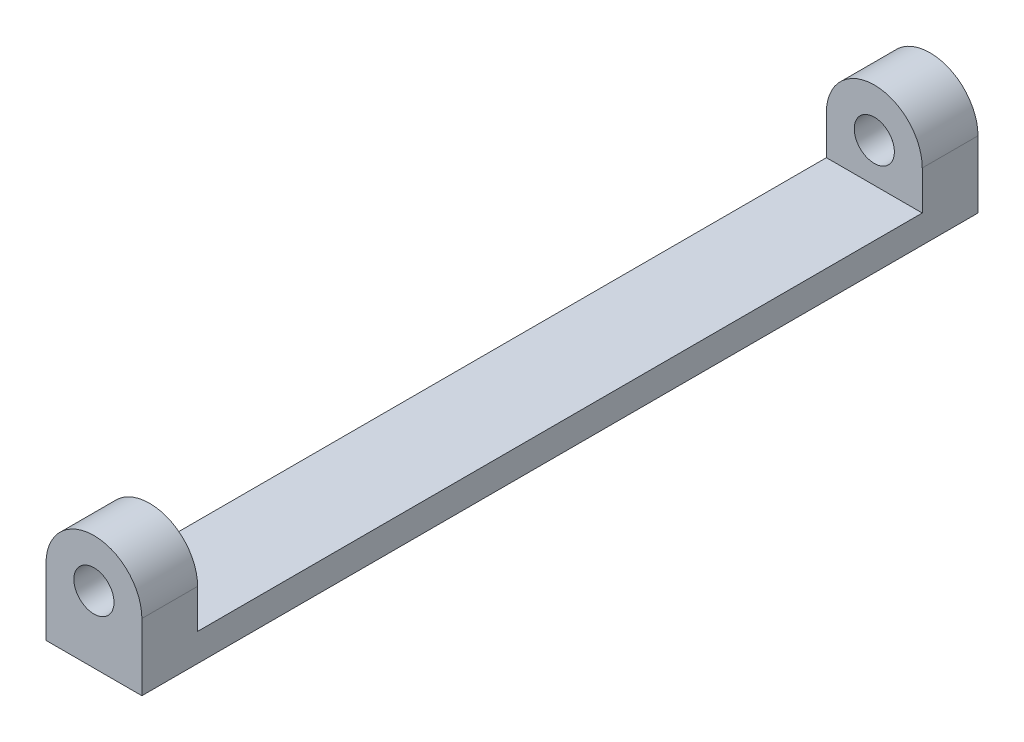
ISO-10303-21;
HEADER;
FILE_DESCRIPTION(('STEP AP214'),'2;1');
FILE_NAME('part.step','',(''),(''),'','','');
FILE_SCHEMA(('AUTOMOTIVE_DESIGN { 1 0 10303 214 1 1 1 1 }'));
ENDSEC;
DATA;
#1=APPLICATION_CONTEXT('core data for automotive mechanical design processes');
#2=APPLICATION_PROTOCOL_DEFINITION('international standard','automotive_design',2000,#1);
#3=PRODUCT_CONTEXT('',#1,'mechanical');
#4=PRODUCT('Part','Part','',(#3));
#5=PRODUCT_RELATED_PRODUCT_CATEGORY('part','',(#4));
#6=PRODUCT_DEFINITION_FORMATION('','',#4);
#7=PRODUCT_DEFINITION_CONTEXT('part definition',#1,'design');
#8=PRODUCT_DEFINITION('design','',#6,#7);
#9=PRODUCT_DEFINITION_SHAPE('','',#8);
#10=(LENGTH_UNIT() NAMED_UNIT(*) SI_UNIT(.MILLI.,.METRE.));
#11=(NAMED_UNIT(*) PLANE_ANGLE_UNIT() SI_UNIT($,.RADIAN.));
#12=(NAMED_UNIT(*) SI_UNIT($,.STERADIAN.) SOLID_ANGLE_UNIT());
#13=UNCERTAINTY_MEASURE_WITH_UNIT(LENGTH_MEASURE(1.E-05),#10,'distance_accuracy_value','');
#14=(GEOMETRIC_REPRESENTATION_CONTEXT(3) GLOBAL_UNCERTAINTY_ASSIGNED_CONTEXT((#13)) GLOBAL_UNIT_ASSIGNED_CONTEXT((#10,
#11,#12)) REPRESENTATION_CONTEXT('',''));
#15=CARTESIAN_POINT('',(0.,0.,0.));
#16=DIRECTION('',(0.,0.,1.));
#17=DIRECTION('',(1.,0.,0.));
#18=AXIS2_PLACEMENT_3D('',#15,#16,#17);
#19=CARTESIAN_POINT('',(5.461,7.62,95.25));
#20=DIRECTION('',(0.,0.,-1.));
#21=DIRECTION('',(-1.,0.,0.));
#22=AXIS2_PLACEMENT_3D('',#19,#20,#21);
#23=CYLINDRICAL_SURFACE('',#22,5.461);
#24=DIRECTION('',(0.,0.,-1.));
#25=VECTOR('',#24,1.);
#26=CARTESIAN_POINT('',(10.922,7.62,95.25));
#27=LINE('',#26,#25);
#28=CARTESIAN_POINT('',(10.922,7.62,95.25));
#29=VERTEX_POINT('',#28);
#30=CARTESIAN_POINT('',(10.922,7.62,88.9));
#31=VERTEX_POINT('',#30);
#32=EDGE_CURVE('E195',#29,#31,#27,.T.);
#33=ORIENTED_EDGE('',*,*,#32,.T.);
#34=CARTESIAN_POINT('',(5.461,7.62,88.9));
#35=DIRECTION('',(0.,0.,1.));
#36=DIRECTION('',(1.,0.,0.));
#37=AXIS2_PLACEMENT_3D('',#34,#35,#36);
#38=CIRCLE('',#37,5.461);
#39=CARTESIAN_POINT('',(0.,7.62,88.9));
#40=VERTEX_POINT('',#39);
#41=EDGE_CURVE('E160',#31,#40,#38,.T.);
#42=ORIENTED_EDGE('',*,*,#41,.T.);
#43=DIRECTION('',(0.,0.,-1.));
#44=VECTOR('',#43,1.);
#45=CARTESIAN_POINT('',(0.,7.62,95.25));
#46=LINE('',#45,#44);
#47=CARTESIAN_POINT('',(0.,7.62,95.25));
#48=VERTEX_POINT('',#47);
#49=EDGE_CURVE('E139',#48,#40,#46,.T.);
#50=ORIENTED_EDGE('',*,*,#49,.F.);
#51=CARTESIAN_POINT('',(5.461,7.62,95.25));
#52=DIRECTION('',(0.,0.,1.));
#53=DIRECTION('',(1.,0.,0.));
#54=AXIS2_PLACEMENT_3D('',#51,#52,#53);
#55=CIRCLE('',#54,5.461);
#56=EDGE_CURVE('E59',#29,#48,#55,.T.);
#57=ORIENTED_EDGE('',*,*,#56,.F.);
#58=EDGE_LOOP('',(#33,#42,#50,#57));
#59=FACE_BOUND('',#58,.T.);
#60=ADVANCED_FACE('F39',(#59),#23,.T.);
#61=CARTESIAN_POINT('',(5.461,7.62,95.25));
#62=DIRECTION('',(0.,0.,-1.));
#63=DIRECTION('',(-1.,0.,0.));
#64=AXIS2_PLACEMENT_3D('',#61,#62,#63);
#65=CYLINDRICAL_SURFACE('',#64,2.286);
#66=CARTESIAN_POINT('',(5.461,7.62,88.9));
#67=DIRECTION('',(0.,0.,1.));
#68=DIRECTION('',(1.,0.,0.));
#69=AXIS2_PLACEMENT_3D('',#66,#67,#68);
#70=CIRCLE('',#69,2.286);
#71=CARTESIAN_POINT('',(7.747,7.62,88.9));
#72=VERTEX_POINT('',#71);
#73=EDGE_CURVE('E43',#72,#72,#70,.T.);
#74=ORIENTED_EDGE('',*,*,#73,.F.);
#75=EDGE_LOOP('',(#74));
#76=FACE_BOUND('',#75,.T.);
#77=CARTESIAN_POINT('',(5.461,7.62,95.25));
#78=DIRECTION('',(0.,0.,1.));
#79=DIRECTION('',(1.,0.,0.));
#80=AXIS2_PLACEMENT_3D('',#77,#78,#79);
#81=CIRCLE('',#80,2.286);
#82=CARTESIAN_POINT('',(7.747,7.62,95.25));
#83=VERTEX_POINT('',#82);
#84=EDGE_CURVE('E164',#83,#83,#81,.T.);
#85=ORIENTED_EDGE('',*,*,#84,.T.);
#86=EDGE_LOOP('',(#85));
#87=FACE_BOUND('',#86,.T.);
#88=ADVANCED_FACE('F213',(#76,#87),#65,.F.);
#89=CARTESIAN_POINT('',(5.461,7.62,95.25));
#90=DIRECTION('',(0.,0.,1.));
#91=DIRECTION('',(1.,0.,0.));
#92=AXIS2_PLACEMENT_3D('',#89,#90,#91);
#93=PLANE('',#92);
#94=DIRECTION('',(0.,-1.,0.));
#95=VECTOR('',#94,1.);
#96=CARTESIAN_POINT('',(0.,0.,95.25));
#97=LINE('',#96,#95);
#98=CARTESIAN_POINT('',(0.,0.,95.25));
#99=VERTEX_POINT('',#98);
#100=EDGE_CURVE('E172',#48,#99,#97,.T.);
#101=ORIENTED_EDGE('',*,*,#100,.T.);
#102=DIRECTION('',(1.,0.,0.));
#103=VECTOR('',#102,1.);
#104=CARTESIAN_POINT('',(0.,0.,95.25));
#105=LINE('',#104,#103);
#106=CARTESIAN_POINT('',(10.922,0.,95.25));
#107=VERTEX_POINT('',#106);
#108=EDGE_CURVE('E91',#99,#107,#105,.T.);
#109=ORIENTED_EDGE('',*,*,#108,.T.);
#110=DIRECTION('',(0.,1.,0.));
#111=VECTOR('',#110,1.);
#112=CARTESIAN_POINT('',(10.922,0.,95.25));
#113=LINE('',#112,#111);
#114=EDGE_CURVE('E178',#107,#29,#113,.T.);
#115=ORIENTED_EDGE('',*,*,#114,.T.);
#116=ORIENTED_EDGE('',*,*,#56,.T.);
#117=EDGE_LOOP('',(#101,#109,#115,#116));
#118=FACE_BOUND('',#117,.T.);
#119=ORIENTED_EDGE('',*,*,#84,.F.);
#120=EDGE_LOOP('',(#119));
#121=FACE_BOUND('',#120,.T.);
#122=ADVANCED_FACE('F218',(#118,#121),#93,.T.);
#123=CARTESIAN_POINT('',(5.461,7.62,0.));
#124=DIRECTION('',(0.,0.,1.));
#125=DIRECTION('',(1.,0.,0.));
#126=AXIS2_PLACEMENT_3D('',#123,#124,#125);
#127=PLANE('',#126);
#128=DIRECTION('',(0.,-1.,0.));
#129=VECTOR('',#128,1.);
#130=CARTESIAN_POINT('',(0.,0.,0.));
#131=LINE('',#130,#129);
#132=CARTESIAN_POINT('',(0.,7.62,0.));
#133=VERTEX_POINT('',#132);
#134=CARTESIAN_POINT('',(0.,0.,0.));
#135=VERTEX_POINT('',#134);
#136=EDGE_CURVE('E168',#133,#135,#131,.T.);
#137=ORIENTED_EDGE('',*,*,#136,.F.);
#138=CARTESIAN_POINT('',(5.461,7.62,0.));
#139=DIRECTION('',(0.,0.,1.));
#140=DIRECTION('',(1.,0.,0.));
#141=AXIS2_PLACEMENT_3D('',#138,#139,#140);
#142=CIRCLE('',#141,5.461);
#143=CARTESIAN_POINT('',(10.922,7.62,0.));
#144=VERTEX_POINT('',#143);
#145=EDGE_CURVE('E175',#144,#133,#142,.T.);
#146=ORIENTED_EDGE('',*,*,#145,.F.);
#147=DIRECTION('',(0.,1.,0.));
#148=VECTOR('',#147,1.);
#149=CARTESIAN_POINT('',(10.922,0.,0.));
#150=LINE('',#149,#148);
#151=CARTESIAN_POINT('',(10.922,0.,0.));
#152=VERTEX_POINT('',#151);
#153=EDGE_CURVE('E188',#152,#144,#150,.T.);
#154=ORIENTED_EDGE('',*,*,#153,.F.);
#155=DIRECTION('',(1.,0.,0.));
#156=VECTOR('',#155,1.);
#157=CARTESIAN_POINT('',(0.,0.,0.));
#158=LINE('',#157,#156);
#159=EDGE_CURVE('E185',#135,#152,#158,.T.);
#160=ORIENTED_EDGE('',*,*,#159,.F.);
#161=EDGE_LOOP('',(#137,#146,#154,#160));
#162=FACE_BOUND('',#161,.T.);
#163=CARTESIAN_POINT('',(5.461,7.62,0.));
#164=DIRECTION('',(0.,0.,1.));
#165=DIRECTION('',(1.,0.,0.));
#166=AXIS2_PLACEMENT_3D('',#163,#164,#165);
#167=CIRCLE('',#166,2.286);
#168=CARTESIAN_POINT('',(7.747,7.62,0.));
#169=VERTEX_POINT('',#168);
#170=EDGE_CURVE('E163',#169,#169,#167,.T.);
#171=ORIENTED_EDGE('',*,*,#170,.T.);
#172=EDGE_LOOP('',(#171));
#173=FACE_BOUND('',#172,.T.);
#174=ADVANCED_FACE('F216',(#162,#173),#127,.F.);
#175=CARTESIAN_POINT('',(0.,0.,95.25));
#176=DIRECTION('',(1.,0.,0.));
#177=DIRECTION('',(0.,0.,-1.));
#178=AXIS2_PLACEMENT_3D('',#175,#176,#177);
#179=PLANE('',#178);
#180=ORIENTED_EDGE('',*,*,#49,.T.);
#181=DIRECTION('',(0.,-1.,0.));
#182=VECTOR('',#181,1.);
#183=CARTESIAN_POINT('',(0.,13.081,88.9));
#184=LINE('',#183,#182);
#185=CARTESIAN_POINT('',(0.,3.175,88.9));
#186=VERTEX_POINT('',#185);
#187=EDGE_CURVE('E121',#40,#186,#184,.T.);
#188=ORIENTED_EDGE('',*,*,#187,.T.);
#189=DIRECTION('',(0.,0.,-1.));
#190=VECTOR('',#189,1.);
#191=CARTESIAN_POINT('',(0.,3.175,88.9));
#192=LINE('',#191,#190);
#193=CARTESIAN_POINT('',(0.,3.17499999999999,6.34999999999999));
#194=VERTEX_POINT('',#193);
#195=EDGE_CURVE('E133',#186,#194,#192,.T.);
#196=ORIENTED_EDGE('',*,*,#195,.T.);
#197=DIRECTION('',(0.,1.,0.));
#198=VECTOR('',#197,1.);
#199=CARTESIAN_POINT('',(0.,13.081,6.35));
#200=LINE('',#199,#198);
#201=CARTESIAN_POINT('',(0.,7.62,6.35));
#202=VERTEX_POINT('',#201);
#203=EDGE_CURVE('E130',#194,#202,#200,.T.);
#204=ORIENTED_EDGE('',*,*,#203,.T.);
#205=EDGE_CURVE('E85',#202,#133,#46,.T.);
#206=ORIENTED_EDGE('',*,*,#205,.T.);
#207=ORIENTED_EDGE('',*,*,#136,.T.);
#208=DIRECTION('',(0.,0.,-1.));
#209=VECTOR('',#208,1.);
#210=CARTESIAN_POINT('',(0.,0.,95.25));
#211=LINE('',#210,#209);
#212=EDGE_CURVE('E11',#99,#135,#211,.T.);
#213=ORIENTED_EDGE('',*,*,#212,.F.);
#214=ORIENTED_EDGE('',*,*,#100,.F.);
#215=EDGE_LOOP('',(#180,#188,#196,#204,#206,#207,#213,#214));
#216=FACE_BOUND('',#215,.T.);
#217=ADVANCED_FACE('F41',(#216),#179,.F.);
#218=CARTESIAN_POINT('',(0.,0.,95.25));
#219=DIRECTION('',(0.,1.,0.));
#220=DIRECTION('',(0.,0.,1.));
#221=AXIS2_PLACEMENT_3D('',#218,#219,#220);
#222=PLANE('',#221);
#223=ORIENTED_EDGE('',*,*,#159,.T.);
#224=DIRECTION('',(0.,0.,-1.));
#225=VECTOR('',#224,1.);
#226=CARTESIAN_POINT('',(10.922,0.,95.25));
#227=LINE('',#226,#225);
#228=EDGE_CURVE('E50',#107,#152,#227,.T.);
#229=ORIENTED_EDGE('',*,*,#228,.F.);
#230=ORIENTED_EDGE('',*,*,#108,.F.);
#231=ORIENTED_EDGE('',*,*,#212,.T.);
#232=EDGE_LOOP('',(#223,#229,#230,#231));
#233=FACE_BOUND('',#232,.T.);
#234=ADVANCED_FACE('F225',(#233),#222,.F.);
#235=CARTESIAN_POINT('',(10.922,0.,95.25));
#236=DIRECTION('',(-1.,0.,0.));
#237=DIRECTION('',(0.,0.,1.));
#238=AXIS2_PLACEMENT_3D('',#235,#236,#237);
#239=PLANE('',#238);
#240=DIRECTION('',(0.,0.,-1.));
#241=VECTOR('',#240,1.);
#242=CARTESIAN_POINT('',(10.922,3.175,88.9));
#243=LINE('',#242,#241);
#244=CARTESIAN_POINT('',(10.922,3.175,88.9));
#245=VERTEX_POINT('',#244);
#246=CARTESIAN_POINT('',(10.922,3.175,6.34999999999999));
#247=VERTEX_POINT('',#246);
#248=EDGE_CURVE('E145',#245,#247,#243,.T.);
#249=ORIENTED_EDGE('',*,*,#248,.F.);
#250=DIRECTION('',(0.,-1.,0.));
#251=VECTOR('',#250,1.);
#252=CARTESIAN_POINT('',(10.922,13.081,88.9));
#253=LINE('',#252,#251);
#254=EDGE_CURVE('E124',#31,#245,#253,.T.);
#255=ORIENTED_EDGE('',*,*,#254,.F.);
#256=ORIENTED_EDGE('',*,*,#32,.F.);
#257=ORIENTED_EDGE('',*,*,#114,.F.);
#258=ORIENTED_EDGE('',*,*,#228,.T.);
#259=ORIENTED_EDGE('',*,*,#153,.T.);
#260=CARTESIAN_POINT('',(10.922,7.62,6.35));
#261=VERTEX_POINT('',#260);
#262=EDGE_CURVE('E77',#261,#144,#27,.T.);
#263=ORIENTED_EDGE('',*,*,#262,.F.);
#264=DIRECTION('',(0.,1.,0.));
#265=VECTOR('',#264,1.);
#266=CARTESIAN_POINT('',(10.922,13.081,6.35));
#267=LINE('',#266,#265);
#268=EDGE_CURVE('E141',#247,#261,#267,.T.);
#269=ORIENTED_EDGE('',*,*,#268,.F.);
#270=EDGE_LOOP('',(#249,#255,#256,#257,#258,#259,#263,#269));
#271=FACE_BOUND('',#270,.T.);
#272=ADVANCED_FACE('F237',(#271),#239,.F.);
#273=CARTESIAN_POINT('',(5.461,7.62,6.34999999999999));
#274=DIRECTION('',(0.,0.,-1.));
#275=DIRECTION('',(0.,1.,0.));
#276=AXIS2_PLACEMENT_3D('',#273,#274,#275);
#277=CIRCLE('',#276,5.461);
#278=EDGE_CURVE('E157',#202,#261,#277,.T.);
#279=ORIENTED_EDGE('',*,*,#278,.T.);
#280=ORIENTED_EDGE('',*,*,#262,.T.);
#281=ORIENTED_EDGE('',*,*,#145,.T.);
#282=ORIENTED_EDGE('',*,*,#205,.F.);
#283=EDGE_LOOP('',(#279,#280,#281,#282));
#284=FACE_BOUND('',#283,.T.);
#285=ADVANCED_FACE('F211',(#284),#23,.T.);
#286=CARTESIAN_POINT('',(5.461,7.62,6.34999999999999));
#287=DIRECTION('',(0.,0.,-1.));
#288=DIRECTION('',(0.,1.,0.));
#289=AXIS2_PLACEMENT_3D('',#286,#287,#288);
#290=CIRCLE('',#289,2.286);
#291=CARTESIAN_POINT('',(5.461,9.906,6.35));
#292=VERTEX_POINT('',#291);
#293=EDGE_CURVE('E155',#292,#292,#290,.T.);
#294=ORIENTED_EDGE('',*,*,#293,.F.);
#295=EDGE_LOOP('',(#294));
#296=FACE_BOUND('',#295,.T.);
#297=ORIENTED_EDGE('',*,*,#170,.F.);
#298=EDGE_LOOP('',(#297));
#299=FACE_BOUND('',#298,.T.);
#300=ADVANCED_FACE('F208',(#296,#299),#65,.F.);
#301=CARTESIAN_POINT('',(0.,13.081,88.9));
#302=DIRECTION('',(0.,0.,1.));
#303=DIRECTION('',(1.,0.,0.));
#304=AXIS2_PLACEMENT_3D('',#301,#302,#303);
#305=PLANE('',#304);
#306=ORIENTED_EDGE('',*,*,#73,.T.);
#307=EDGE_LOOP('',(#306));
#308=FACE_BOUND('',#307,.T.);
#309=ORIENTED_EDGE('',*,*,#254,.T.);
#310=DIRECTION('',(1.,0.,0.));
#311=VECTOR('',#310,1.);
#312=CARTESIAN_POINT('',(0.,3.175,88.9));
#313=LINE('',#312,#311);
#314=EDGE_CURVE('E117',#186,#245,#313,.T.);
#315=ORIENTED_EDGE('',*,*,#314,.F.);
#316=ORIENTED_EDGE('',*,*,#187,.F.);
#317=ORIENTED_EDGE('',*,*,#41,.F.);
#318=EDGE_LOOP('',(#309,#315,#316,#317));
#319=FACE_BOUND('',#318,.T.);
#320=ADVANCED_FACE('F119',(#308,#319),#305,.F.);
#321=CARTESIAN_POINT('',(0.,13.081,6.35));
#322=DIRECTION('',(0.,0.,-1.));
#323=DIRECTION('',(0.,1.,0.));
#324=AXIS2_PLACEMENT_3D('',#321,#322,#323);
#325=PLANE('',#324);
#326=ORIENTED_EDGE('',*,*,#293,.T.);
#327=EDGE_LOOP('',(#326));
#328=FACE_BOUND('',#327,.T.);
#329=ORIENTED_EDGE('',*,*,#278,.F.);
#330=ORIENTED_EDGE('',*,*,#203,.F.);
#331=DIRECTION('',(1.,0.,0.));
#332=VECTOR('',#331,1.);
#333=CARTESIAN_POINT('',(0.,3.17499999999999,6.34999999999999));
#334=LINE('',#333,#332);
#335=EDGE_CURVE('E129',#194,#247,#334,.T.);
#336=ORIENTED_EDGE('',*,*,#335,.T.);
#337=ORIENTED_EDGE('',*,*,#268,.T.);
#338=EDGE_LOOP('',(#329,#330,#336,#337));
#339=FACE_BOUND('',#338,.T.);
#340=ADVANCED_FACE('F205',(#328,#339),#325,.F.);
#341=CARTESIAN_POINT('',(0.,3.175,88.9));
#342=DIRECTION('',(0.,-1.,0.));
#343=DIRECTION('',(1.,0.,0.));
#344=AXIS2_PLACEMENT_3D('',#341,#342,#343);
#345=PLANE('',#344);
#346=ORIENTED_EDGE('',*,*,#248,.T.);
#347=ORIENTED_EDGE('',*,*,#335,.F.);
#348=ORIENTED_EDGE('',*,*,#195,.F.);
#349=ORIENTED_EDGE('',*,*,#314,.T.);
#350=EDGE_LOOP('',(#346,#347,#348,#349));
#351=FACE_BOUND('',#350,.T.);
#352=ADVANCED_FACE('F134',(#351),#345,.F.);
#353=CLOSED_SHELL('',(#60,#88,#122,#174,#217,#234,#272,#285,#300,#320,#340,#352));
#354=MANIFOLD_SOLID_BREP('B2',#353);
#355=ADVANCED_BREP_SHAPE_REPRESENTATION('',(#18,#354),#14);
#356=SHAPE_DEFINITION_REPRESENTATION(#9,#355);
ENDSEC;
END-ISO-10303-21;
